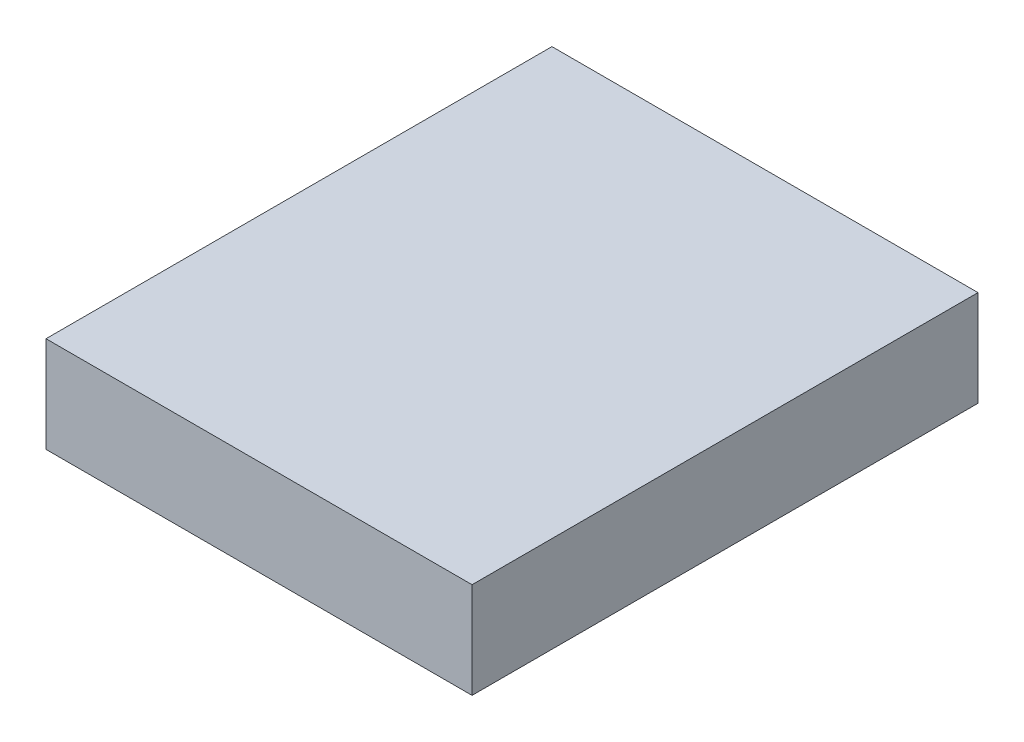
ISO-10303-21;
HEADER;
FILE_DESCRIPTION(('STEP AP214'),'2;1');
FILE_NAME('part.step','',(''),(''),'','','');
FILE_SCHEMA(('AUTOMOTIVE_DESIGN { 1 0 10303 214 1 1 1 1 }'));
ENDSEC;
DATA;
#1=APPLICATION_CONTEXT('core data for automotive mechanical design processes');
#2=APPLICATION_PROTOCOL_DEFINITION('international standard','automotive_design',2000,#1);
#3=PRODUCT_CONTEXT('',#1,'mechanical');
#4=PRODUCT('Part','Part','',(#3));
#5=PRODUCT_RELATED_PRODUCT_CATEGORY('part','',(#4));
#6=PRODUCT_DEFINITION_FORMATION('','',#4);
#7=PRODUCT_DEFINITION_CONTEXT('part definition',#1,'design');
#8=PRODUCT_DEFINITION('design','',#6,#7);
#9=PRODUCT_DEFINITION_SHAPE('','',#8);
#10=(LENGTH_UNIT() NAMED_UNIT(*) SI_UNIT(.MILLI.,.METRE.));
#11=(NAMED_UNIT(*) PLANE_ANGLE_UNIT() SI_UNIT($,.RADIAN.));
#12=(NAMED_UNIT(*) SI_UNIT($,.STERADIAN.) SOLID_ANGLE_UNIT());
#13=UNCERTAINTY_MEASURE_WITH_UNIT(LENGTH_MEASURE(1.E-05),#10,'distance_accuracy_value','');
#14=(GEOMETRIC_REPRESENTATION_CONTEXT(3) GLOBAL_UNCERTAINTY_ASSIGNED_CONTEXT((#13)) GLOBAL_UNIT_ASSIGNED_CONTEXT((#10,
#11,#12)) REPRESENTATION_CONTEXT('',''));
#15=CARTESIAN_POINT('',(0.,0.,0.));
#16=DIRECTION('',(0.,0.,1.));
#17=DIRECTION('',(1.,0.,0.));
#18=AXIS2_PLACEMENT_3D('',#15,#16,#17);
#19=CARTESIAN_POINT('',(-81.7486042814241,18.,-51.1965947742858));
#20=DIRECTION('',(1.,0.,0.));
#21=DIRECTION('',(0.,0.,-1.));
#22=AXIS2_PLACEMENT_3D('',#19,#20,#21);
#23=PLANE('',#22);
#24=DIRECTION('',(0.,0.,1.));
#25=VECTOR('',#24,1.);
#26=CARTESIAN_POINT('',(-81.7486042814241,0.,-51.1965947742858));
#27=LINE('',#26,#25);
#28=CARTESIAN_POINT('',(-81.7486042814241,0.,-51.1965947742858));
#29=VERTEX_POINT('',#28);
#30=CARTESIAN_POINT('',(-81.7486042814241,0.,43.8034052257142));
#31=VERTEX_POINT('',#30);
#32=EDGE_CURVE('E96',#29,#31,#27,.T.);
#33=ORIENTED_EDGE('',*,*,#32,.T.);
#34=DIRECTION('',(0.,-1.,0.));
#35=VECTOR('',#34,1.);
#36=CARTESIAN_POINT('',(-81.7486042814241,18.,43.8034052257142));
#37=LINE('',#36,#35);
#38=CARTESIAN_POINT('',(-81.7486042814241,18.,43.8034052257142));
#39=VERTEX_POINT('',#38);
#40=EDGE_CURVE('E11',#39,#31,#37,.T.);
#41=ORIENTED_EDGE('',*,*,#40,.F.);
#42=DIRECTION('',(0.,0.,1.));
#43=VECTOR('',#42,1.);
#44=CARTESIAN_POINT('',(-81.7486042814241,18.,-51.1965947742858));
#45=LINE('',#44,#43);
#46=CARTESIAN_POINT('',(-81.7486042814241,18.,-51.1965947742858));
#47=VERTEX_POINT('',#46);
#48=EDGE_CURVE('E84',#47,#39,#45,.T.);
#49=ORIENTED_EDGE('',*,*,#48,.F.);
#50=DIRECTION('',(0.,-1.,0.));
#51=VECTOR('',#50,1.);
#52=CARTESIAN_POINT('',(-81.7486042814241,18.,-51.1965947742858));
#53=LINE('',#52,#51);
#54=EDGE_CURVE('E92',#47,#29,#53,.T.);
#55=ORIENTED_EDGE('',*,*,#54,.T.);
#56=EDGE_LOOP('',(#33,#41,#49,#55));
#57=FACE_BOUND('',#56,.T.);
#58=ADVANCED_FACE('F33',(#57),#23,.F.);
#59=CARTESIAN_POINT('',(-81.7486042814241,18.,43.8034052257142));
#60=DIRECTION('',(0.,0.,-1.));
#61=DIRECTION('',(-1.,0.,0.));
#62=AXIS2_PLACEMENT_3D('',#59,#60,#61);
#63=PLANE('',#62);
#64=DIRECTION('',(1.,0.,0.));
#65=VECTOR('',#64,1.);
#66=CARTESIAN_POINT('',(-81.7486042814241,0.,43.8034052257142));
#67=LINE('',#66,#65);
#68=CARTESIAN_POINT('',(-1.74860428142412,0.,43.8034052257142));
#69=VERTEX_POINT('',#68);
#70=EDGE_CURVE('E88',#31,#69,#67,.T.);
#71=ORIENTED_EDGE('',*,*,#70,.T.);
#72=DIRECTION('',(0.,-1.,0.));
#73=VECTOR('',#72,1.);
#74=CARTESIAN_POINT('',(-1.74860428142412,18.,43.8034052257142));
#75=LINE('',#74,#73);
#76=CARTESIAN_POINT('',(-1.74860428142412,18.,43.8034052257142));
#77=VERTEX_POINT('',#76);
#78=EDGE_CURVE('E41',#77,#69,#75,.T.);
#79=ORIENTED_EDGE('',*,*,#78,.F.);
#80=DIRECTION('',(1.,0.,0.));
#81=VECTOR('',#80,1.);
#82=CARTESIAN_POINT('',(-81.7486042814241,18.,43.8034052257142));
#83=LINE('',#82,#81);
#84=EDGE_CURVE('E79',#39,#77,#83,.T.);
#85=ORIENTED_EDGE('',*,*,#84,.F.);
#86=ORIENTED_EDGE('',*,*,#40,.T.);
#87=EDGE_LOOP('',(#71,#79,#85,#86));
#88=FACE_BOUND('',#87,.T.);
#89=ADVANCED_FACE('F87',(#88),#63,.F.);
#90=CARTESIAN_POINT('',(-1.74860428142413,18.,-51.1965947742858));
#91=DIRECTION('',(-1.,0.,0.));
#92=DIRECTION('',(0.,0.,1.));
#93=AXIS2_PLACEMENT_3D('',#90,#91,#92);
#94=PLANE('',#93);
#95=DIRECTION('',(0.,0.,-1.));
#96=VECTOR('',#95,1.);
#97=CARTESIAN_POINT('',(-1.74860428142413,0.,-51.1965947742858));
#98=LINE('',#97,#96);
#99=CARTESIAN_POINT('',(-1.74860428142413,0.,-51.1965947742858));
#100=VERTEX_POINT('',#99);
#101=EDGE_CURVE('E66',#69,#100,#98,.T.);
#102=ORIENTED_EDGE('',*,*,#101,.T.);
#103=DIRECTION('',(0.,-1.,0.));
#104=VECTOR('',#103,1.);
#105=CARTESIAN_POINT('',(-1.74860428142413,18.,-51.1965947742858));
#106=LINE('',#105,#104);
#107=CARTESIAN_POINT('',(-1.74860428142413,18.,-51.1965947742858));
#108=VERTEX_POINT('',#107);
#109=EDGE_CURVE('E89',#108,#100,#106,.T.);
#110=ORIENTED_EDGE('',*,*,#109,.F.);
#111=DIRECTION('',(0.,0.,-1.));
#112=VECTOR('',#111,1.);
#113=CARTESIAN_POINT('',(-1.74860428142413,18.,-51.1965947742858));
#114=LINE('',#113,#112);
#115=EDGE_CURVE('E82',#77,#108,#114,.T.);
#116=ORIENTED_EDGE('',*,*,#115,.F.);
#117=ORIENTED_EDGE('',*,*,#78,.T.);
#118=EDGE_LOOP('',(#102,#110,#116,#117));
#119=FACE_BOUND('',#118,.T.);
#120=ADVANCED_FACE('F90',(#119),#94,.F.);
#121=CARTESIAN_POINT('',(-81.7486042814241,18.,-51.1965947742858));
#122=DIRECTION('',(0.,0.,1.));
#123=DIRECTION('',(1.,0.,0.));
#124=AXIS2_PLACEMENT_3D('',#121,#122,#123);
#125=PLANE('',#124);
#126=DIRECTION('',(-1.,0.,0.));
#127=VECTOR('',#126,1.);
#128=CARTESIAN_POINT('',(-81.7486042814241,0.,-51.1965947742858));
#129=LINE('',#128,#127);
#130=EDGE_CURVE('E72',#100,#29,#129,.T.);
#131=ORIENTED_EDGE('',*,*,#130,.T.);
#132=ORIENTED_EDGE('',*,*,#54,.F.);
#133=DIRECTION('',(-1.,0.,0.));
#134=VECTOR('',#133,1.);
#135=CARTESIAN_POINT('',(-81.7486042814241,18.,-51.1965947742858));
#136=LINE('',#135,#134);
#137=EDGE_CURVE('E49',#108,#47,#136,.T.);
#138=ORIENTED_EDGE('',*,*,#137,.F.);
#139=ORIENTED_EDGE('',*,*,#109,.T.);
#140=EDGE_LOOP('',(#131,#132,#138,#139));
#141=FACE_BOUND('',#140,.T.);
#142=ADVANCED_FACE('F103',(#141),#125,.F.);
#143=CARTESIAN_POINT('',(0.,18.,0.));
#144=DIRECTION('',(0.,1.,0.));
#145=DIRECTION('',(0.,0.,1.));
#146=AXIS2_PLACEMENT_3D('',#143,#144,#145);
#147=PLANE('',#146);
#148=ORIENTED_EDGE('',*,*,#48,.T.);
#149=ORIENTED_EDGE('',*,*,#84,.T.);
#150=ORIENTED_EDGE('',*,*,#115,.T.);
#151=ORIENTED_EDGE('',*,*,#137,.T.);
#152=EDGE_LOOP('',(#148,#149,#150,#151));
#153=FACE_BOUND('',#152,.T.);
#154=ADVANCED_FACE('F80',(#153),#147,.T.);
#155=CARTESIAN_POINT('',(0.,0.,0.));
#156=DIRECTION('',(0.,1.,0.));
#157=DIRECTION('',(0.,0.,1.));
#158=AXIS2_PLACEMENT_3D('',#155,#156,#157);
#159=PLANE('',#158);
#160=ORIENTED_EDGE('',*,*,#32,.F.);
#161=ORIENTED_EDGE('',*,*,#130,.F.);
#162=ORIENTED_EDGE('',*,*,#101,.F.);
#163=ORIENTED_EDGE('',*,*,#70,.F.);
#164=EDGE_LOOP('',(#160,#161,#162,#163));
#165=FACE_BOUND('',#164,.T.);
#166=ADVANCED_FACE('F106',(#165),#159,.F.);
#167=CLOSED_SHELL('',(#58,#89,#120,#142,#154,#166));
#168=MANIFOLD_SOLID_BREP('B2',#167);
#169=ADVANCED_BREP_SHAPE_REPRESENTATION('',(#18,#168),#14);
#170=SHAPE_DEFINITION_REPRESENTATION(#9,#169);
ENDSEC;
END-ISO-10303-21;
